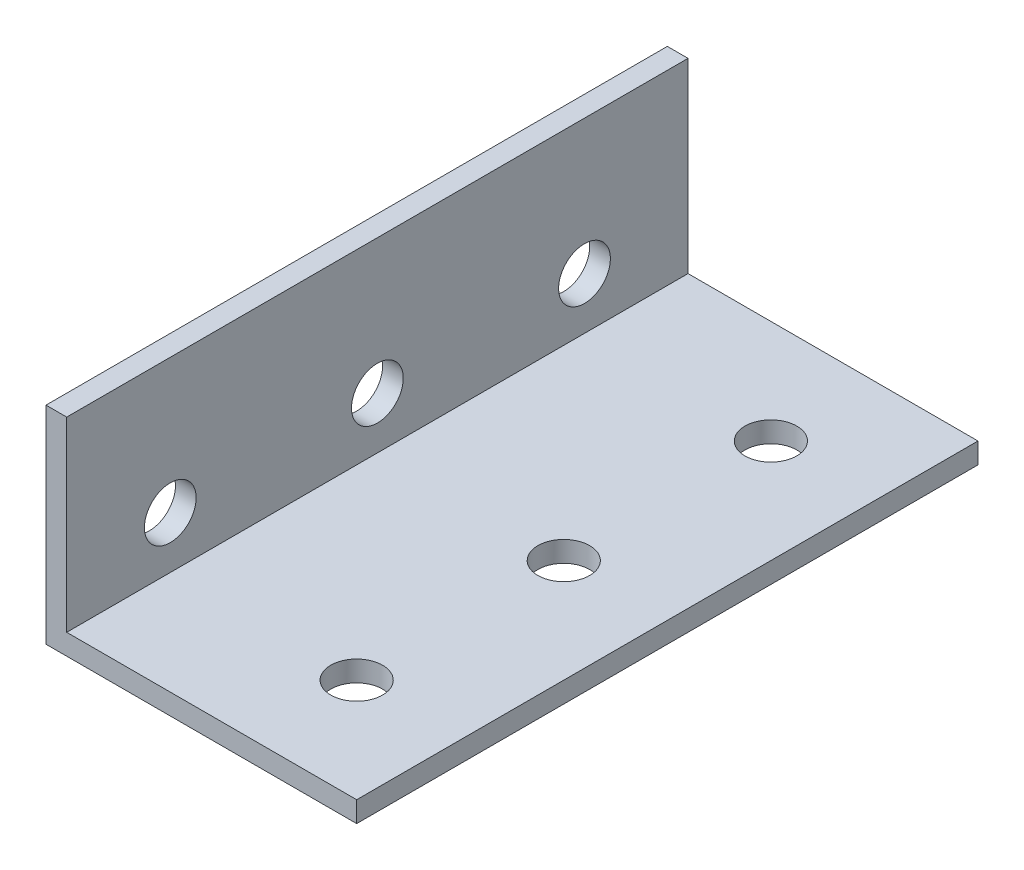
ISO-10303-21;
HEADER;
FILE_DESCRIPTION(('STEP AP214'),'2;1');
FILE_NAME('part.step','',(''),(''),'','','');
FILE_SCHEMA(('AUTOMOTIVE_DESIGN { 1 0 10303 214 1 1 1 1 }'));
ENDSEC;
DATA;
#1=APPLICATION_CONTEXT('core data for automotive mechanical design processes');
#2=APPLICATION_PROTOCOL_DEFINITION('international standard','automotive_design',2000,#1);
#3=PRODUCT_CONTEXT('',#1,'mechanical');
#4=PRODUCT('Part','Part','',(#3));
#5=PRODUCT_RELATED_PRODUCT_CATEGORY('part','',(#4));
#6=PRODUCT_DEFINITION_FORMATION('','',#4);
#7=PRODUCT_DEFINITION_CONTEXT('part definition',#1,'design');
#8=PRODUCT_DEFINITION('design','',#6,#7);
#9=PRODUCT_DEFINITION_SHAPE('','',#8);
#10=(LENGTH_UNIT() NAMED_UNIT(*) SI_UNIT(.MILLI.,.METRE.));
#11=(NAMED_UNIT(*) PLANE_ANGLE_UNIT() SI_UNIT($,.RADIAN.));
#12=(NAMED_UNIT(*) SI_UNIT($,.STERADIAN.) SOLID_ANGLE_UNIT());
#13=UNCERTAINTY_MEASURE_WITH_UNIT(LENGTH_MEASURE(1.E-05),#10,'distance_accuracy_value','');
#14=(GEOMETRIC_REPRESENTATION_CONTEXT(3) GLOBAL_UNCERTAINTY_ASSIGNED_CONTEXT((#13)) GLOBAL_UNIT_ASSIGNED_CONTEXT((#10,
#11,#12)) REPRESENTATION_CONTEXT('',''));
#15=CARTESIAN_POINT('',(0.,0.,0.));
#16=DIRECTION('',(0.,0.,1.));
#17=DIRECTION('',(1.,0.,0.));
#18=AXIS2_PLACEMENT_3D('',#15,#16,#17);
#19=CARTESIAN_POINT('',(30.,0.,60.));
#20=DIRECTION('',(0.,1.,0.));
#21=DIRECTION('',(-1.,0.,0.));
#22=AXIS2_PLACEMENT_3D('',#19,#20,#21);
#23=PLANE('',#22);
#24=CARTESIAN_POINT('',(20.,0.,50.));
#25=DIRECTION('',(0.,1.,0.));
#26=DIRECTION('',(-1.,0.,0.));
#27=AXIS2_PLACEMENT_3D('',#24,#25,#26);
#28=CIRCLE('',#27,2.5);
#29=CARTESIAN_POINT('',(17.5,0.,50.));
#30=VERTEX_POINT('',#29);
#31=EDGE_CURVE('E135',#30,#30,#28,.T.);
#32=ORIENTED_EDGE('',*,*,#31,.T.);
#33=EDGE_LOOP('',(#32));
#34=FACE_BOUND('',#33,.T.);
#35=CARTESIAN_POINT('',(20.,0.,10.));
#36=DIRECTION('',(0.,1.,0.));
#37=DIRECTION('',(-1.,0.,0.));
#38=AXIS2_PLACEMENT_3D('',#35,#36,#37);
#39=CIRCLE('',#38,2.5);
#40=CARTESIAN_POINT('',(17.5,0.,10.));
#41=VERTEX_POINT('',#40);
#42=EDGE_CURVE('E190',#41,#41,#39,.T.);
#43=ORIENTED_EDGE('',*,*,#42,.T.);
#44=EDGE_LOOP('',(#43));
#45=FACE_BOUND('',#44,.T.);
#46=CARTESIAN_POINT('',(20.,0.,30.));
#47=DIRECTION('',(0.,1.,0.));
#48=DIRECTION('',(-1.,0.,0.));
#49=AXIS2_PLACEMENT_3D('',#46,#47,#48);
#50=CIRCLE('',#49,2.5);
#51=CARTESIAN_POINT('',(17.5,0.,30.));
#52=VERTEX_POINT('',#51);
#53=EDGE_CURVE('E186',#52,#52,#50,.T.);
#54=ORIENTED_EDGE('',*,*,#53,.T.);
#55=EDGE_LOOP('',(#54));
#56=FACE_BOUND('',#55,.T.);
#57=DIRECTION('',(1.,0.,0.));
#58=VECTOR('',#57,1.);
#59=CARTESIAN_POINT('',(30.,0.,0.));
#60=LINE('',#59,#58);
#61=CARTESIAN_POINT('',(0.,0.,0.));
#62=VERTEX_POINT('',#61);
#63=CARTESIAN_POINT('',(30.,0.,0.));
#64=VERTEX_POINT('',#63);
#65=EDGE_CURVE('E130',#62,#64,#60,.T.);
#66=ORIENTED_EDGE('',*,*,#65,.T.);
#67=DIRECTION('',(0.,0.,-1.));
#68=VECTOR('',#67,1.);
#69=CARTESIAN_POINT('',(30.,0.,60.));
#70=LINE('',#69,#68);
#71=CARTESIAN_POINT('',(30.,0.,60.));
#72=VERTEX_POINT('',#71);
#73=EDGE_CURVE('E11',#72,#64,#70,.T.);
#74=ORIENTED_EDGE('',*,*,#73,.F.);
#75=DIRECTION('',(1.,0.,0.));
#76=VECTOR('',#75,1.);
#77=CARTESIAN_POINT('',(30.,0.,60.));
#78=LINE('',#77,#76);
#79=CARTESIAN_POINT('',(0.,0.,60.));
#80=VERTEX_POINT('',#79);
#81=EDGE_CURVE('E147',#80,#72,#78,.T.);
#82=ORIENTED_EDGE('',*,*,#81,.F.);
#83=DIRECTION('',(0.,0.,-1.));
#84=VECTOR('',#83,1.);
#85=CARTESIAN_POINT('',(0.,0.,60.));
#86=LINE('',#85,#84);
#87=EDGE_CURVE('E126',#80,#62,#86,.T.);
#88=ORIENTED_EDGE('',*,*,#87,.T.);
#89=EDGE_LOOP('',(#66,#74,#82,#88));
#90=FACE_BOUND('',#89,.T.);
#91=ADVANCED_FACE('F39',(#34,#45,#56,#90),#23,.F.);
#92=CARTESIAN_POINT('',(30.,2.,60.));
#93=DIRECTION('',(-1.,0.,0.));
#94=DIRECTION('',(0.,0.,1.));
#95=AXIS2_PLACEMENT_3D('',#92,#93,#94);
#96=PLANE('',#95);
#97=DIRECTION('',(0.,1.,0.));
#98=VECTOR('',#97,1.);
#99=CARTESIAN_POINT('',(30.,2.,0.));
#100=LINE('',#99,#98);
#101=CARTESIAN_POINT('',(30.,2.,0.));
#102=VERTEX_POINT('',#101);
#103=EDGE_CURVE('E134',#64,#102,#100,.T.);
#104=ORIENTED_EDGE('',*,*,#103,.T.);
#105=DIRECTION('',(0.,0.,-1.));
#106=VECTOR('',#105,1.);
#107=CARTESIAN_POINT('',(30.,2.,60.));
#108=LINE('',#107,#106);
#109=CARTESIAN_POINT('',(30.,2.,60.));
#110=VERTEX_POINT('',#109);
#111=EDGE_CURVE('E49',#110,#102,#108,.T.);
#112=ORIENTED_EDGE('',*,*,#111,.F.);
#113=DIRECTION('',(0.,1.,0.));
#114=VECTOR('',#113,1.);
#115=CARTESIAN_POINT('',(30.,2.,60.));
#116=LINE('',#115,#114);
#117=EDGE_CURVE('E95',#72,#110,#116,.T.);
#118=ORIENTED_EDGE('',*,*,#117,.F.);
#119=ORIENTED_EDGE('',*,*,#73,.T.);
#120=EDGE_LOOP('',(#104,#112,#118,#119));
#121=FACE_BOUND('',#120,.T.);
#122=ADVANCED_FACE('F203',(#121),#96,.F.);
#123=CARTESIAN_POINT('',(2.,2.,60.));
#124=DIRECTION('',(0.,-1.,0.));
#125=DIRECTION('',(0.,0.,-1.));
#126=AXIS2_PLACEMENT_3D('',#123,#124,#125);
#127=PLANE('',#126);
#128=CARTESIAN_POINT('',(20.,2.,50.));
#129=DIRECTION('',(0.,1.,0.));
#130=DIRECTION('',(0.,0.,1.));
#131=AXIS2_PLACEMENT_3D('',#128,#129,#130);
#132=CIRCLE('',#131,2.5);
#133=CARTESIAN_POINT('',(20.,2.,52.5));
#134=VERTEX_POINT('',#133);
#135=EDGE_CURVE('E168',#134,#134,#132,.T.);
#136=ORIENTED_EDGE('',*,*,#135,.F.);
#137=EDGE_LOOP('',(#136));
#138=FACE_BOUND('',#137,.T.);
#139=CARTESIAN_POINT('',(20.,2.,10.));
#140=DIRECTION('',(0.,1.,0.));
#141=DIRECTION('',(0.,0.,1.));
#142=AXIS2_PLACEMENT_3D('',#139,#140,#141);
#143=CIRCLE('',#142,2.5);
#144=CARTESIAN_POINT('',(20.,2.,12.5));
#145=VERTEX_POINT('',#144);
#146=EDGE_CURVE('E173',#145,#145,#143,.T.);
#147=ORIENTED_EDGE('',*,*,#146,.F.);
#148=EDGE_LOOP('',(#147));
#149=FACE_BOUND('',#148,.T.);
#150=CARTESIAN_POINT('',(20.,2.,30.));
#151=DIRECTION('',(0.,1.,0.));
#152=DIRECTION('',(0.,0.,1.));
#153=AXIS2_PLACEMENT_3D('',#150,#151,#152);
#154=CIRCLE('',#153,2.5);
#155=CARTESIAN_POINT('',(20.,2.,32.5));
#156=VERTEX_POINT('',#155);
#157=EDGE_CURVE('E179',#156,#156,#154,.T.);
#158=ORIENTED_EDGE('',*,*,#157,.F.);
#159=EDGE_LOOP('',(#158));
#160=FACE_BOUND('',#159,.T.);
#161=DIRECTION('',(-1.,0.,0.));
#162=VECTOR('',#161,1.);
#163=CARTESIAN_POINT('',(2.,2.,0.));
#164=LINE('',#163,#162);
#165=CARTESIAN_POINT('',(2.,2.,0.));
#166=VERTEX_POINT('',#165);
#167=EDGE_CURVE('E138',#102,#166,#164,.T.);
#168=ORIENTED_EDGE('',*,*,#167,.T.);
#169=DIRECTION('',(0.,0.,-1.));
#170=VECTOR('',#169,1.);
#171=CARTESIAN_POINT('',(2.,2.,60.));
#172=LINE('',#171,#170);
#173=CARTESIAN_POINT('',(2.,2.,60.));
#174=VERTEX_POINT('',#173);
#175=EDGE_CURVE('E119',#174,#166,#172,.T.);
#176=ORIENTED_EDGE('',*,*,#175,.F.);
#177=DIRECTION('',(-1.,0.,0.));
#178=VECTOR('',#177,1.);
#179=CARTESIAN_POINT('',(2.,2.,60.));
#180=LINE('',#179,#178);
#181=EDGE_CURVE('E108',#110,#174,#180,.T.);
#182=ORIENTED_EDGE('',*,*,#181,.F.);
#183=ORIENTED_EDGE('',*,*,#111,.T.);
#184=EDGE_LOOP('',(#168,#176,#182,#183));
#185=FACE_BOUND('',#184,.T.);
#186=ADVANCED_FACE('F206',(#138,#149,#160,#185),#127,.F.);
#187=CARTESIAN_POINT('',(2.,20.,60.));
#188=DIRECTION('',(-1.,0.,0.));
#189=DIRECTION('',(0.,-1.,0.));
#190=AXIS2_PLACEMENT_3D('',#187,#188,#189);
#191=PLANE('',#190);
#192=CARTESIAN_POINT('',(2.,7.,50.));
#193=DIRECTION('',(1.,0.,0.));
#194=DIRECTION('',(0.,1.,0.));
#195=AXIS2_PLACEMENT_3D('',#192,#193,#194);
#196=CIRCLE('',#195,2.5);
#197=CARTESIAN_POINT('',(2.,9.5,50.));
#198=VERTEX_POINT('',#197);
#199=EDGE_CURVE('E266',#198,#198,#196,.T.);
#200=ORIENTED_EDGE('',*,*,#199,.F.);
#201=EDGE_LOOP('',(#200));
#202=FACE_BOUND('',#201,.T.);
#203=CARTESIAN_POINT('',(2.,7.,10.));
#204=DIRECTION('',(1.,0.,0.));
#205=DIRECTION('',(0.,1.,0.));
#206=AXIS2_PLACEMENT_3D('',#203,#204,#205);
#207=CIRCLE('',#206,2.5);
#208=CARTESIAN_POINT('',(2.,9.5,10.));
#209=VERTEX_POINT('',#208);
#210=EDGE_CURVE('E263',#209,#209,#207,.T.);
#211=ORIENTED_EDGE('',*,*,#210,.F.);
#212=EDGE_LOOP('',(#211));
#213=FACE_BOUND('',#212,.T.);
#214=CARTESIAN_POINT('',(2.,7.,30.));
#215=DIRECTION('',(1.,0.,0.));
#216=DIRECTION('',(0.,1.,0.));
#217=AXIS2_PLACEMENT_3D('',#214,#215,#216);
#218=CIRCLE('',#217,2.5);
#219=CARTESIAN_POINT('',(2.,9.5,30.));
#220=VERTEX_POINT('',#219);
#221=EDGE_CURVE('E161',#220,#220,#218,.T.);
#222=ORIENTED_EDGE('',*,*,#221,.F.);
#223=EDGE_LOOP('',(#222));
#224=FACE_BOUND('',#223,.T.);
#225=DIRECTION('',(0.,1.,0.));
#226=VECTOR('',#225,1.);
#227=CARTESIAN_POINT('',(2.,20.,0.));
#228=LINE('',#227,#226);
#229=CARTESIAN_POINT('',(2.,20.,0.));
#230=VERTEX_POINT('',#229);
#231=EDGE_CURVE('E117',#166,#230,#228,.T.);
#232=ORIENTED_EDGE('',*,*,#231,.T.);
#233=DIRECTION('',(0.,0.,-1.));
#234=VECTOR('',#233,1.);
#235=CARTESIAN_POINT('',(2.,20.,60.));
#236=LINE('',#235,#234);
#237=CARTESIAN_POINT('',(2.,20.,60.));
#238=VERTEX_POINT('',#237);
#239=EDGE_CURVE('E114',#238,#230,#236,.T.);
#240=ORIENTED_EDGE('',*,*,#239,.F.);
#241=DIRECTION('',(0.,1.,0.));
#242=VECTOR('',#241,1.);
#243=CARTESIAN_POINT('',(2.,20.,60.));
#244=LINE('',#243,#242);
#245=EDGE_CURVE('E102',#174,#238,#244,.T.);
#246=ORIENTED_EDGE('',*,*,#245,.F.);
#247=ORIENTED_EDGE('',*,*,#175,.T.);
#248=EDGE_LOOP('',(#232,#240,#246,#247));
#249=FACE_BOUND('',#248,.T.);
#250=ADVANCED_FACE('F115',(#202,#213,#224,#249),#191,.F.);
#251=CARTESIAN_POINT('',(0.,20.,60.));
#252=DIRECTION('',(0.,-1.,0.));
#253=DIRECTION('',(0.,0.,-1.));
#254=AXIS2_PLACEMENT_3D('',#251,#252,#253);
#255=PLANE('',#254);
#256=DIRECTION('',(-1.,0.,0.));
#257=VECTOR('',#256,1.);
#258=CARTESIAN_POINT('',(0.,20.,0.));
#259=LINE('',#258,#257);
#260=CARTESIAN_POINT('',(0.,20.,0.));
#261=VERTEX_POINT('',#260);
#262=EDGE_CURVE('E81',#230,#261,#259,.T.);
#263=ORIENTED_EDGE('',*,*,#262,.T.);
#264=DIRECTION('',(0.,0.,-1.));
#265=VECTOR('',#264,1.);
#266=CARTESIAN_POINT('',(0.,20.,60.));
#267=LINE('',#266,#265);
#268=CARTESIAN_POINT('',(0.,20.,60.));
#269=VERTEX_POINT('',#268);
#270=EDGE_CURVE('E120',#269,#261,#267,.T.);
#271=ORIENTED_EDGE('',*,*,#270,.F.);
#272=DIRECTION('',(-1.,0.,0.));
#273=VECTOR('',#272,1.);
#274=CARTESIAN_POINT('',(0.,20.,60.));
#275=LINE('',#274,#273);
#276=EDGE_CURVE('E106',#238,#269,#275,.T.);
#277=ORIENTED_EDGE('',*,*,#276,.F.);
#278=ORIENTED_EDGE('',*,*,#239,.T.);
#279=EDGE_LOOP('',(#263,#271,#277,#278));
#280=FACE_BOUND('',#279,.T.);
#281=ADVANCED_FACE('F122',(#280),#255,.F.);
#282=CARTESIAN_POINT('',(0.,0.,60.));
#283=DIRECTION('',(1.,0.,0.));
#284=DIRECTION('',(0.,0.,-1.));
#285=AXIS2_PLACEMENT_3D('',#282,#283,#284);
#286=PLANE('',#285);
#287=CARTESIAN_POINT('',(0.,7.,50.));
#288=DIRECTION('',(1.,0.,0.));
#289=DIRECTION('',(0.,0.,-1.));
#290=AXIS2_PLACEMENT_3D('',#287,#288,#289);
#291=CIRCLE('',#290,2.5);
#292=CARTESIAN_POINT('',(0.,7.,47.5));
#293=VERTEX_POINT('',#292);
#294=EDGE_CURVE('E42',#293,#293,#291,.T.);
#295=ORIENTED_EDGE('',*,*,#294,.T.);
#296=EDGE_LOOP('',(#295));
#297=FACE_BOUND('',#296,.T.);
#298=CARTESIAN_POINT('',(0.,7.,10.));
#299=DIRECTION('',(1.,0.,0.));
#300=DIRECTION('',(0.,0.,-1.));
#301=AXIS2_PLACEMENT_3D('',#298,#299,#300);
#302=CIRCLE('',#301,2.5);
#303=CARTESIAN_POINT('',(0.,7.,7.5));
#304=VERTEX_POINT('',#303);
#305=EDGE_CURVE('E160',#304,#304,#302,.T.);
#306=ORIENTED_EDGE('',*,*,#305,.T.);
#307=EDGE_LOOP('',(#306));
#308=FACE_BOUND('',#307,.T.);
#309=CARTESIAN_POINT('',(0.,7.,30.));
#310=DIRECTION('',(1.,0.,0.));
#311=DIRECTION('',(0.,0.,-1.));
#312=AXIS2_PLACEMENT_3D('',#309,#310,#311);
#313=CIRCLE('',#312,2.5);
#314=CARTESIAN_POINT('',(0.,7.,27.5));
#315=VERTEX_POINT('',#314);
#316=EDGE_CURVE('E157',#315,#315,#313,.T.);
#317=ORIENTED_EDGE('',*,*,#316,.T.);
#318=EDGE_LOOP('',(#317));
#319=FACE_BOUND('',#318,.T.);
#320=DIRECTION('',(0.,-1.,0.));
#321=VECTOR('',#320,1.);
#322=CARTESIAN_POINT('',(0.,0.,0.));
#323=LINE('',#322,#321);
#324=EDGE_CURVE('E87',#261,#62,#323,.T.);
#325=ORIENTED_EDGE('',*,*,#324,.T.);
#326=ORIENTED_EDGE('',*,*,#87,.F.);
#327=DIRECTION('',(0.,-1.,0.));
#328=VECTOR('',#327,1.);
#329=CARTESIAN_POINT('',(0.,0.,60.));
#330=LINE('',#329,#328);
#331=EDGE_CURVE('E58',#269,#80,#330,.T.);
#332=ORIENTED_EDGE('',*,*,#331,.F.);
#333=ORIENTED_EDGE('',*,*,#270,.T.);
#334=EDGE_LOOP('',(#325,#326,#332,#333));
#335=FACE_BOUND('',#334,.T.);
#336=ADVANCED_FACE('F211',(#297,#308,#319,#335),#286,.F.);
#337=CARTESIAN_POINT('',(0.,0.,60.));
#338=DIRECTION('',(0.,0.,-1.));
#339=DIRECTION('',(-1.,0.,0.));
#340=AXIS2_PLACEMENT_3D('',#337,#338,#339);
#341=PLANE('',#340);
#342=ORIENTED_EDGE('',*,*,#81,.T.);
#343=ORIENTED_EDGE('',*,*,#117,.T.);
#344=ORIENTED_EDGE('',*,*,#181,.T.);
#345=ORIENTED_EDGE('',*,*,#245,.T.);
#346=ORIENTED_EDGE('',*,*,#276,.T.);
#347=ORIENTED_EDGE('',*,*,#331,.T.);
#348=EDGE_LOOP('',(#342,#343,#344,#345,#346,#347));
#349=FACE_BOUND('',#348,.T.);
#350=ADVANCED_FACE('F104',(#349),#341,.F.);
#351=CARTESIAN_POINT('',(0.,0.,0.));
#352=DIRECTION('',(0.,0.,-1.));
#353=DIRECTION('',(-1.,0.,0.));
#354=AXIS2_PLACEMENT_3D('',#351,#352,#353);
#355=PLANE('',#354);
#356=ORIENTED_EDGE('',*,*,#65,.F.);
#357=ORIENTED_EDGE('',*,*,#324,.F.);
#358=ORIENTED_EDGE('',*,*,#262,.F.);
#359=ORIENTED_EDGE('',*,*,#231,.F.);
#360=ORIENTED_EDGE('',*,*,#167,.F.);
#361=ORIENTED_EDGE('',*,*,#103,.F.);
#362=EDGE_LOOP('',(#356,#357,#358,#359,#360,#361));
#363=FACE_BOUND('',#362,.T.);
#364=ADVANCED_FACE('F209',(#363),#355,.T.);
#365=CARTESIAN_POINT('',(20.,-8.,30.));
#366=DIRECTION('',(0.,1.,0.));
#367=DIRECTION('',(0.,0.,1.));
#368=AXIS2_PLACEMENT_3D('',#365,#366,#367);
#369=CYLINDRICAL_SURFACE('',#368,2.5);
#370=ORIENTED_EDGE('',*,*,#157,.T.);
#371=EDGE_LOOP('',(#370));
#372=FACE_BOUND('',#371,.T.);
#373=ORIENTED_EDGE('',*,*,#53,.F.);
#374=EDGE_LOOP('',(#373));
#375=FACE_BOUND('',#374,.T.);
#376=ADVANCED_FACE('F232',(#372,#375),#369,.F.);
#377=CARTESIAN_POINT('',(20.,-8.,10.));
#378=DIRECTION('',(0.,1.,0.));
#379=DIRECTION('',(0.,0.,1.));
#380=AXIS2_PLACEMENT_3D('',#377,#378,#379);
#381=CYLINDRICAL_SURFACE('',#380,2.5);
#382=ORIENTED_EDGE('',*,*,#146,.T.);
#383=EDGE_LOOP('',(#382));
#384=FACE_BOUND('',#383,.T.);
#385=ORIENTED_EDGE('',*,*,#42,.F.);
#386=EDGE_LOOP('',(#385));
#387=FACE_BOUND('',#386,.T.);
#388=ADVANCED_FACE('F234',(#384,#387),#381,.F.);
#389=CARTESIAN_POINT('',(20.,-8.,50.));
#390=DIRECTION('',(0.,1.,0.));
#391=DIRECTION('',(0.,0.,1.));
#392=AXIS2_PLACEMENT_3D('',#389,#390,#391);
#393=CYLINDRICAL_SURFACE('',#392,2.5);
#394=ORIENTED_EDGE('',*,*,#135,.T.);
#395=EDGE_LOOP('',(#394));
#396=FACE_BOUND('',#395,.T.);
#397=ORIENTED_EDGE('',*,*,#31,.F.);
#398=EDGE_LOOP('',(#397));
#399=FACE_BOUND('',#398,.T.);
#400=ADVANCED_FACE('F241',(#396,#399),#393,.F.);
#401=CARTESIAN_POINT('',(-8.,7.,30.));
#402=DIRECTION('',(1.,0.,0.));
#403=DIRECTION('',(0.,1.,0.));
#404=AXIS2_PLACEMENT_3D('',#401,#402,#403);
#405=CYLINDRICAL_SURFACE('',#404,2.5);
#406=ORIENTED_EDGE('',*,*,#221,.T.);
#407=EDGE_LOOP('',(#406));
#408=FACE_BOUND('',#407,.T.);
#409=ORIENTED_EDGE('',*,*,#316,.F.);
#410=EDGE_LOOP('',(#409));
#411=FACE_BOUND('',#410,.T.);
#412=ADVANCED_FACE('F246',(#408,#411),#405,.F.);
#413=CARTESIAN_POINT('',(-8.,7.,10.));
#414=DIRECTION('',(1.,0.,0.));
#415=DIRECTION('',(0.,1.,0.));
#416=AXIS2_PLACEMENT_3D('',#413,#414,#415);
#417=CYLINDRICAL_SURFACE('',#416,2.5);
#418=ORIENTED_EDGE('',*,*,#210,.T.);
#419=EDGE_LOOP('',(#418));
#420=FACE_BOUND('',#419,.T.);
#421=ORIENTED_EDGE('',*,*,#305,.F.);
#422=EDGE_LOOP('',(#421));
#423=FACE_BOUND('',#422,.T.);
#424=ADVANCED_FACE('F250',(#420,#423),#417,.F.);
#425=CARTESIAN_POINT('',(-8.,7.,50.));
#426=DIRECTION('',(1.,0.,0.));
#427=DIRECTION('',(0.,1.,0.));
#428=AXIS2_PLACEMENT_3D('',#425,#426,#427);
#429=CYLINDRICAL_SURFACE('',#428,2.5);
#430=ORIENTED_EDGE('',*,*,#199,.T.);
#431=EDGE_LOOP('',(#430));
#432=FACE_BOUND('',#431,.T.);
#433=ORIENTED_EDGE('',*,*,#294,.F.);
#434=EDGE_LOOP('',(#433));
#435=FACE_BOUND('',#434,.T.);
#436=ADVANCED_FACE('F252',(#432,#435),#429,.F.);
#437=CLOSED_SHELL('',(#91,#122,#186,#250,#281,#336,#350,#364,#376,#388,#400,#412,#424,#436));
#438=MANIFOLD_SOLID_BREP('B2',#437);
#439=ADVANCED_BREP_SHAPE_REPRESENTATION('',(#18,#438),#14);
#440=SHAPE_DEFINITION_REPRESENTATION(#9,#439);
ENDSEC;
END-ISO-10303-21;
